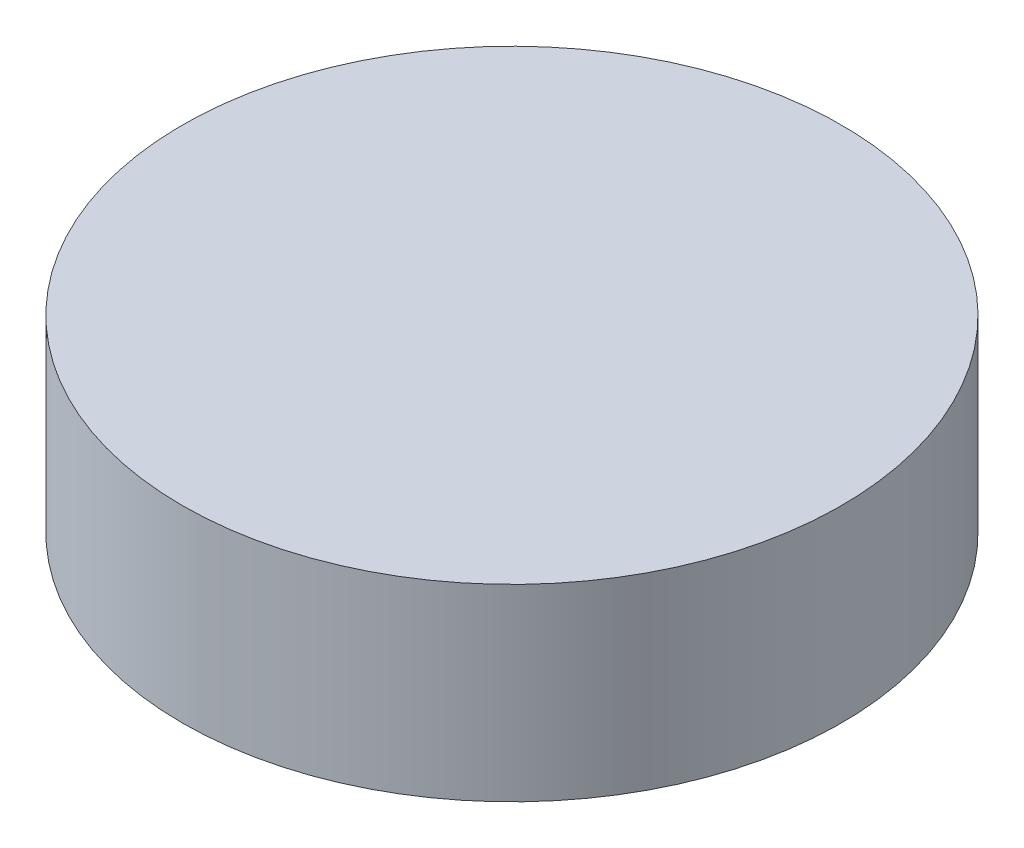
ISO-10303-21;
HEADER;
FILE_DESCRIPTION(('STEP AP214'),'2;1');
FILE_NAME('part.step','',(''),(''),'','','');
FILE_SCHEMA(('AUTOMOTIVE_DESIGN { 1 0 10303 214 1 1 1 1 }'));
ENDSEC;
DATA;
#1=APPLICATION_CONTEXT('core data for automotive mechanical design processes');
#2=APPLICATION_PROTOCOL_DEFINITION('international standard','automotive_design',2000,#1);
#3=PRODUCT_CONTEXT('',#1,'mechanical');
#4=PRODUCT('Part','Part','',(#3));
#5=PRODUCT_RELATED_PRODUCT_CATEGORY('part','',(#4));
#6=PRODUCT_DEFINITION_FORMATION('','',#4);
#7=PRODUCT_DEFINITION_CONTEXT('part definition',#1,'design');
#8=PRODUCT_DEFINITION('design','',#6,#7);
#9=PRODUCT_DEFINITION_SHAPE('','',#8);
#10=(LENGTH_UNIT() NAMED_UNIT(*) SI_UNIT(.MILLI.,.METRE.));
#11=(NAMED_UNIT(*) PLANE_ANGLE_UNIT() SI_UNIT($,.RADIAN.));
#12=(NAMED_UNIT(*) SI_UNIT($,.STERADIAN.) SOLID_ANGLE_UNIT());
#13=UNCERTAINTY_MEASURE_WITH_UNIT(LENGTH_MEASURE(1.E-05),#10,'distance_accuracy_value','');
#14=(GEOMETRIC_REPRESENTATION_CONTEXT(3) GLOBAL_UNCERTAINTY_ASSIGNED_CONTEXT((#13)) GLOBAL_UNIT_ASSIGNED_CONTEXT((#10,
#11,#12)) REPRESENTATION_CONTEXT('',''));
#15=CARTESIAN_POINT('',(0.,0.,0.));
#16=DIRECTION('',(0.,0.,1.));
#17=DIRECTION('',(1.,0.,0.));
#18=AXIS2_PLACEMENT_3D('',#15,#16,#17);
#19=CARTESIAN_POINT('',(0.,5.,0.));
#20=DIRECTION('',(0.,-1.,0.));
#21=DIRECTION('',(0.,0.,-1.));
#22=AXIS2_PLACEMENT_3D('',#19,#20,#21);
#23=CYLINDRICAL_SURFACE('',#22,8.75);
#24=CARTESIAN_POINT('',(0.,5.,0.));
#25=DIRECTION('',(0.,1.,0.));
#26=DIRECTION('',(0.,0.,1.));
#27=AXIS2_PLACEMENT_3D('',#24,#25,#26);
#28=CIRCLE('',#27,8.75);
#29=CARTESIAN_POINT('',(0.,5.,8.75));
#30=VERTEX_POINT('',#29);
#31=EDGE_CURVE('E10',#30,#30,#28,.T.);
#32=ORIENTED_EDGE('',*,*,#31,.F.);
#33=EDGE_LOOP('',(#32));
#34=FACE_BOUND('',#33,.T.);
#35=CARTESIAN_POINT('',(0.,0.,0.));
#36=DIRECTION('',(0.,1.,0.));
#37=DIRECTION('',(0.,0.,1.));
#38=AXIS2_PLACEMENT_3D('',#35,#36,#37);
#39=CIRCLE('',#38,8.75);
#40=CARTESIAN_POINT('',(0.,0.,8.75));
#41=VERTEX_POINT('',#40);
#42=EDGE_CURVE('E32',#41,#41,#39,.T.);
#43=ORIENTED_EDGE('',*,*,#42,.T.);
#44=EDGE_LOOP('',(#43));
#45=FACE_BOUND('',#44,.T.);
#46=ADVANCED_FACE('F29',(#34,#45),#23,.T.);
#47=CARTESIAN_POINT('',(0.,5.,0.));
#48=DIRECTION('',(0.,1.,0.));
#49=DIRECTION('',(0.,0.,1.));
#50=AXIS2_PLACEMENT_3D('',#47,#48,#49);
#51=PLANE('',#50);
#52=ORIENTED_EDGE('',*,*,#31,.T.);
#53=EDGE_LOOP('',(#52));
#54=FACE_BOUND('',#53,.T.);
#55=ADVANCED_FACE('F44',(#54),#51,.T.);
#56=CARTESIAN_POINT('',(0.,0.,0.));
#57=DIRECTION('',(0.,1.,0.));
#58=DIRECTION('',(0.,0.,1.));
#59=AXIS2_PLACEMENT_3D('',#56,#57,#58);
#60=PLANE('',#59);
#61=ORIENTED_EDGE('',*,*,#42,.F.);
#62=EDGE_LOOP('',(#61));
#63=FACE_BOUND('',#62,.T.);
#64=ADVANCED_FACE('F42',(#63),#60,.F.);
#65=CLOSED_SHELL('',(#46,#55,#64));
#66=MANIFOLD_SOLID_BREP('B2',#65);
#67=ADVANCED_BREP_SHAPE_REPRESENTATION('',(#18,#66),#14);
#68=SHAPE_DEFINITION_REPRESENTATION(#9,#67);
ENDSEC;
END-ISO-10303-21;
